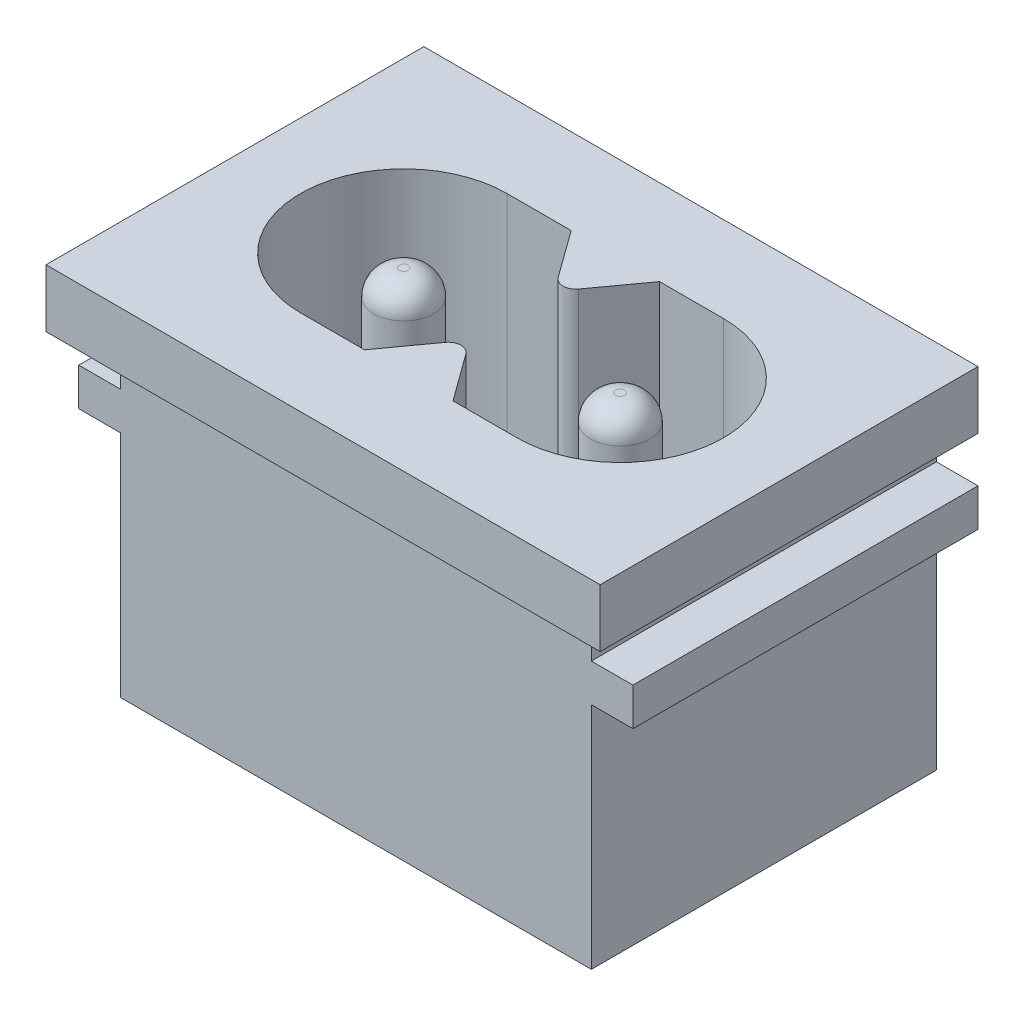
ISO-10303-21;
HEADER;
FILE_DESCRIPTION(('STEP AP214'),'2;1');
FILE_NAME('part.step','',(''),(''),'','','');
FILE_SCHEMA(('AUTOMOTIVE_DESIGN { 1 0 10303 214 1 1 1 1 }'));
ENDSEC;
DATA;
#1=APPLICATION_CONTEXT('core data for automotive mechanical design processes');
#2=APPLICATION_PROTOCOL_DEFINITION('international standard','automotive_design',2000,#1);
#3=PRODUCT_CONTEXT('',#1,'mechanical');
#4=PRODUCT('Part','Part','',(#3));
#5=PRODUCT_RELATED_PRODUCT_CATEGORY('part','',(#4));
#6=PRODUCT_DEFINITION_FORMATION('','',#4);
#7=PRODUCT_DEFINITION_CONTEXT('part definition',#1,'design');
#8=PRODUCT_DEFINITION('design','',#6,#7);
#9=PRODUCT_DEFINITION_SHAPE('','',#8);
#10=(LENGTH_UNIT() NAMED_UNIT(*) SI_UNIT(.MILLI.,.METRE.));
#11=(NAMED_UNIT(*) PLANE_ANGLE_UNIT() SI_UNIT($,.RADIAN.));
#12=(NAMED_UNIT(*) SI_UNIT($,.STERADIAN.) SOLID_ANGLE_UNIT());
#13=UNCERTAINTY_MEASURE_WITH_UNIT(LENGTH_MEASURE(1.E-05),#10,'distance_accuracy_value','');
#14=(GEOMETRIC_REPRESENTATION_CONTEXT(3) GLOBAL_UNCERTAINTY_ASSIGNED_CONTEXT((#13)) GLOBAL_UNIT_ASSIGNED_CONTEXT((#10,
#11,#12)) REPRESENTATION_CONTEXT('',''));
#15=CARTESIAN_POINT('',(0.,0.,0.));
#16=DIRECTION('',(0.,0.,1.));
#17=DIRECTION('',(1.,0.,0.));
#18=AXIS2_PLACEMENT_3D('',#15,#16,#17);
#19=CARTESIAN_POINT('',(9.35,-12.4,-7.5));
#20=DIRECTION('',(-1.,0.,0.));
#21=DIRECTION('',(0.,0.,1.));
#22=AXIS2_PLACEMENT_3D('',#19,#20,#21);
#23=PLANE('',#22);
#24=DIRECTION('',(0.,0.,-1.));
#25=VECTOR('',#24,1.);
#26=CARTESIAN_POINT('',(9.35,-3.3,6.2));
#27=LINE('',#26,#25);
#28=CARTESIAN_POINT('',(9.35,-3.3,6.2));
#29=VERTEX_POINT('',#28);
#30=CARTESIAN_POINT('',(9.35,-3.3,-7.5));
#31=VERTEX_POINT('',#30);
#32=EDGE_CURVE('E342',#29,#31,#27,.T.);
#33=ORIENTED_EDGE('',*,*,#32,.F.);
#34=DIRECTION('',(0.,1.,0.));
#35=VECTOR('',#34,1.);
#36=CARTESIAN_POINT('',(9.35,-12.4,6.2));
#37=LINE('',#36,#35);
#38=CARTESIAN_POINT('',(9.35,-12.4,6.2));
#39=VERTEX_POINT('',#38);
#40=EDGE_CURVE('E406',#39,#29,#37,.T.);
#41=ORIENTED_EDGE('',*,*,#40,.F.);
#42=DIRECTION('',(0.,0.,1.));
#43=VECTOR('',#42,1.);
#44=CARTESIAN_POINT('',(9.35,-12.4,-7.5));
#45=LINE('',#44,#43);
#46=CARTESIAN_POINT('',(9.35,-12.4,-7.5));
#47=VERTEX_POINT('',#46);
#48=EDGE_CURVE('E391',#47,#39,#45,.T.);
#49=ORIENTED_EDGE('',*,*,#48,.F.);
#50=DIRECTION('',(0.,1.,0.));
#51=VECTOR('',#50,1.);
#52=CARTESIAN_POINT('',(9.35,-12.4,-7.5));
#53=LINE('',#52,#51);
#54=EDGE_CURVE('E410',#47,#31,#53,.T.);
#55=ORIENTED_EDGE('',*,*,#54,.T.);
#56=EDGE_LOOP('',(#33,#41,#49,#55));
#57=FACE_BOUND('',#56,.T.);
#58=ADVANCED_FACE('F39',(#57),#23,.F.);
#59=DIRECTION('',(0.,0.,1.));
#60=VECTOR('',#59,1.);
#61=CARTESIAN_POINT('',(9.35,-1.8,-7.5));
#62=LINE('',#61,#60);
#63=CARTESIAN_POINT('',(9.35,-1.8,-7.5));
#64=VERTEX_POINT('',#63);
#65=CARTESIAN_POINT('',(9.35,-1.8,6.2));
#66=VERTEX_POINT('',#65);
#67=EDGE_CURVE('E62',#64,#66,#62,.T.);
#68=ORIENTED_EDGE('',*,*,#67,.F.);
#69=CARTESIAN_POINT('',(9.35,0.,-7.5));
#70=VERTEX_POINT('',#69);
#71=EDGE_CURVE('E409',#64,#70,#53,.T.);
#72=ORIENTED_EDGE('',*,*,#71,.T.);
#73=DIRECTION('',(0.,0.,1.));
#74=VECTOR('',#73,1.);
#75=CARTESIAN_POINT('',(9.35,0.,-7.5));
#76=LINE('',#75,#74);
#77=CARTESIAN_POINT('',(9.35,0.,6.2));
#78=VERTEX_POINT('',#77);
#79=EDGE_CURVE('E398',#70,#78,#76,.T.);
#80=ORIENTED_EDGE('',*,*,#79,.T.);
#81=EDGE_CURVE('E405',#66,#78,#37,.T.);
#82=ORIENTED_EDGE('',*,*,#81,.F.);
#83=EDGE_LOOP('',(#68,#72,#80,#82));
#84=FACE_BOUND('',#83,.T.);
#85=ADVANCED_FACE('F468',(#84),#23,.F.);
#86=CARTESIAN_POINT('',(-9.35,-12.4,-7.5));
#87=DIRECTION('',(1.,0.,0.));
#88=DIRECTION('',(0.,0.,-1.));
#89=AXIS2_PLACEMENT_3D('',#86,#87,#88);
#90=PLANE('',#89);
#91=DIRECTION('',(0.,0.,-1.));
#92=VECTOR('',#91,1.);
#93=CARTESIAN_POINT('',(-9.35,-1.8,-7.5));
#94=LINE('',#93,#92);
#95=CARTESIAN_POINT('',(-9.35,-1.8,6.2));
#96=VERTEX_POINT('',#95);
#97=CARTESIAN_POINT('',(-9.35,-1.8,-7.5));
#98=VERTEX_POINT('',#97);
#99=EDGE_CURVE('E368',#96,#98,#94,.T.);
#100=ORIENTED_EDGE('',*,*,#99,.F.);
#101=DIRECTION('',(0.,1.,0.));
#102=VECTOR('',#101,1.);
#103=CARTESIAN_POINT('',(-9.35,-12.4,6.2));
#104=LINE('',#103,#102);
#105=CARTESIAN_POINT('',(-9.35,0.,6.2));
#106=VERTEX_POINT('',#105);
#107=EDGE_CURVE('E395',#96,#106,#104,.T.);
#108=ORIENTED_EDGE('',*,*,#107,.T.);
#109=DIRECTION('',(0.,0.,-1.));
#110=VECTOR('',#109,1.);
#111=CARTESIAN_POINT('',(-9.35,0.,-7.5));
#112=LINE('',#111,#110);
#113=CARTESIAN_POINT('',(-9.35,0.,-7.5));
#114=VERTEX_POINT('',#113);
#115=EDGE_CURVE('E365',#106,#114,#112,.T.);
#116=ORIENTED_EDGE('',*,*,#115,.T.);
#117=DIRECTION('',(0.,1.,0.));
#118=VECTOR('',#117,1.);
#119=CARTESIAN_POINT('',(-9.35,-12.4,-7.5));
#120=LINE('',#119,#118);
#121=EDGE_CURVE('E413',#98,#114,#120,.T.);
#122=ORIENTED_EDGE('',*,*,#121,.F.);
#123=EDGE_LOOP('',(#100,#108,#116,#122));
#124=FACE_BOUND('',#123,.T.);
#125=ADVANCED_FACE('F474',(#124),#90,.F.);
#126=DIRECTION('',(0.,0.,1.));
#127=VECTOR('',#126,1.);
#128=CARTESIAN_POINT('',(-9.35,-3.3,-7.5));
#129=LINE('',#128,#127);
#130=CARTESIAN_POINT('',(-9.35,-3.3,-7.5));
#131=VERTEX_POINT('',#130);
#132=CARTESIAN_POINT('',(-9.35,-3.3,6.2));
#133=VERTEX_POINT('',#132);
#134=EDGE_CURVE('E340',#131,#133,#129,.T.);
#135=ORIENTED_EDGE('',*,*,#134,.F.);
#136=CARTESIAN_POINT('',(-9.35,-12.4,-7.5));
#137=VERTEX_POINT('',#136);
#138=EDGE_CURVE('E414',#137,#131,#120,.T.);
#139=ORIENTED_EDGE('',*,*,#138,.F.);
#140=DIRECTION('',(0.,0.,-1.));
#141=VECTOR('',#140,1.);
#142=CARTESIAN_POINT('',(-9.35,-12.4,-7.5));
#143=LINE('',#142,#141);
#144=CARTESIAN_POINT('',(-9.35,-12.4,6.2));
#145=VERTEX_POINT('',#144);
#146=EDGE_CURVE('E385',#145,#137,#143,.T.);
#147=ORIENTED_EDGE('',*,*,#146,.F.);
#148=EDGE_CURVE('E403',#145,#133,#104,.T.);
#149=ORIENTED_EDGE('',*,*,#148,.T.);
#150=EDGE_LOOP('',(#135,#139,#147,#149));
#151=FACE_BOUND('',#150,.T.);
#152=ADVANCED_FACE('F483',(#151),#90,.F.);
#153=CARTESIAN_POINT('',(0.,0.,0.));
#154=DIRECTION('',(0.,1.,0.));
#155=DIRECTION('',(0.,0.,1.));
#156=AXIS2_PLACEMENT_3D('',#153,#154,#155);
#157=PLANE('',#156);
#158=ORIENTED_EDGE('',*,*,#115,.F.);
#159=DIRECTION('',(-1.,0.,0.));
#160=VECTOR('',#159,1.);
#161=CARTESIAN_POINT('',(-9.35,0.,6.2));
#162=LINE('',#161,#160);
#163=EDGE_CURVE('E389',#78,#106,#162,.T.);
#164=ORIENTED_EDGE('',*,*,#163,.F.);
#165=ORIENTED_EDGE('',*,*,#79,.F.);
#166=DIRECTION('',(-1.,0.,0.));
#167=VECTOR('',#166,1.);
#168=CARTESIAN_POINT('',(11.,0.,-7.5));
#169=LINE('',#168,#167);
#170=CARTESIAN_POINT('',(11.,0.,-7.5));
#171=VERTEX_POINT('',#170);
#172=EDGE_CURVE('E422',#171,#70,#169,.T.);
#173=ORIENTED_EDGE('',*,*,#172,.F.);
#174=DIRECTION('',(0.,0.,-1.));
#175=VECTOR('',#174,1.);
#176=CARTESIAN_POINT('',(11.,0.,7.5));
#177=LINE('',#176,#175);
#178=CARTESIAN_POINT('',(11.,0.,7.5));
#179=VERTEX_POINT('',#178);
#180=EDGE_CURVE('E433',#179,#171,#177,.T.);
#181=ORIENTED_EDGE('',*,*,#180,.F.);
#182=DIRECTION('',(1.,0.,0.));
#183=VECTOR('',#182,1.);
#184=CARTESIAN_POINT('',(11.,0.,7.5));
#185=LINE('',#184,#183);
#186=CARTESIAN_POINT('',(-11.,0.,7.5));
#187=VERTEX_POINT('',#186);
#188=EDGE_CURVE('E431',#187,#179,#185,.T.);
#189=ORIENTED_EDGE('',*,*,#188,.F.);
#190=DIRECTION('',(0.,0.,1.));
#191=VECTOR('',#190,1.);
#192=CARTESIAN_POINT('',(-11.,0.,7.5));
#193=LINE('',#192,#191);
#194=CARTESIAN_POINT('',(-11.,0.,-7.5));
#195=VERTEX_POINT('',#194);
#196=EDGE_CURVE('E417',#195,#187,#193,.T.);
#197=ORIENTED_EDGE('',*,*,#196,.F.);
#198=EDGE_CURVE('E435',#114,#195,#169,.T.);
#199=ORIENTED_EDGE('',*,*,#198,.F.);
#200=EDGE_LOOP('',(#158,#164,#165,#173,#181,#189,#197,#199));
#201=FACE_BOUND('',#200,.T.);
#202=ADVANCED_FACE('F490',(#201),#157,.F.);
#203=CARTESIAN_POINT('',(-11.,2.3,7.5));
#204=DIRECTION('',(1.,0.,0.));
#205=DIRECTION('',(0.,0.,-1.));
#206=AXIS2_PLACEMENT_3D('',#203,#204,#205);
#207=PLANE('',#206);
#208=ORIENTED_EDGE('',*,*,#196,.T.);
#209=DIRECTION('',(0.,-1.,0.));
#210=VECTOR('',#209,1.);
#211=CARTESIAN_POINT('',(-11.,2.3,7.5));
#212=LINE('',#211,#210);
#213=CARTESIAN_POINT('',(-11.,2.3,7.5));
#214=VERTEX_POINT('',#213);
#215=EDGE_CURVE('E446',#214,#187,#212,.T.);
#216=ORIENTED_EDGE('',*,*,#215,.F.);
#217=DIRECTION('',(0.,0.,1.));
#218=VECTOR('',#217,1.);
#219=CARTESIAN_POINT('',(-11.,2.3,7.5));
#220=LINE('',#219,#218);
#221=CARTESIAN_POINT('',(-11.,2.3,-7.5));
#222=VERTEX_POINT('',#221);
#223=EDGE_CURVE('E418',#222,#214,#220,.T.);
#224=ORIENTED_EDGE('',*,*,#223,.F.);
#225=DIRECTION('',(0.,-1.,0.));
#226=VECTOR('',#225,1.);
#227=CARTESIAN_POINT('',(-11.,2.3,-7.5));
#228=LINE('',#227,#226);
#229=EDGE_CURVE('E428',#222,#195,#228,.T.);
#230=ORIENTED_EDGE('',*,*,#229,.T.);
#231=EDGE_LOOP('',(#208,#216,#224,#230));
#232=FACE_BOUND('',#231,.T.);
#233=ADVANCED_FACE('F493',(#232),#207,.F.);
#234=CARTESIAN_POINT('',(11.,2.3,7.5));
#235=DIRECTION('',(0.,0.,-1.));
#236=DIRECTION('',(-1.,0.,0.));
#237=AXIS2_PLACEMENT_3D('',#234,#235,#236);
#238=PLANE('',#237);
#239=ORIENTED_EDGE('',*,*,#188,.T.);
#240=DIRECTION('',(0.,-1.,0.));
#241=VECTOR('',#240,1.);
#242=CARTESIAN_POINT('',(11.,2.3,7.5));
#243=LINE('',#242,#241);
#244=CARTESIAN_POINT('',(11.,2.3,7.5));
#245=VERTEX_POINT('',#244);
#246=EDGE_CURVE('E443',#245,#179,#243,.T.);
#247=ORIENTED_EDGE('',*,*,#246,.F.);
#248=DIRECTION('',(1.,0.,0.));
#249=VECTOR('',#248,1.);
#250=CARTESIAN_POINT('',(11.,2.3,7.5));
#251=LINE('',#250,#249);
#252=EDGE_CURVE('E421',#214,#245,#251,.T.);
#253=ORIENTED_EDGE('',*,*,#252,.F.);
#254=ORIENTED_EDGE('',*,*,#215,.T.);
#255=EDGE_LOOP('',(#239,#247,#253,#254));
#256=FACE_BOUND('',#255,.T.);
#257=ADVANCED_FACE('F501',(#256),#238,.F.);
#258=CARTESIAN_POINT('',(11.,2.3,7.5));
#259=DIRECTION('',(-1.,0.,0.));
#260=DIRECTION('',(0.,0.,1.));
#261=AXIS2_PLACEMENT_3D('',#258,#259,#260);
#262=PLANE('',#261);
#263=ORIENTED_EDGE('',*,*,#180,.T.);
#264=DIRECTION('',(0.,-1.,0.));
#265=VECTOR('',#264,1.);
#266=CARTESIAN_POINT('',(11.,2.3,-7.5));
#267=LINE('',#266,#265);
#268=CARTESIAN_POINT('',(11.,2.3,-7.5));
#269=VERTEX_POINT('',#268);
#270=EDGE_CURVE('E440',#269,#171,#267,.T.);
#271=ORIENTED_EDGE('',*,*,#270,.F.);
#272=DIRECTION('',(0.,0.,-1.));
#273=VECTOR('',#272,1.);
#274=CARTESIAN_POINT('',(11.,2.3,7.5));
#275=LINE('',#274,#273);
#276=EDGE_CURVE('E424',#245,#269,#275,.T.);
#277=ORIENTED_EDGE('',*,*,#276,.F.);
#278=ORIENTED_EDGE('',*,*,#246,.T.);
#279=EDGE_LOOP('',(#263,#271,#277,#278));
#280=FACE_BOUND('',#279,.T.);
#281=ADVANCED_FACE('F497',(#280),#262,.F.);
#282=CARTESIAN_POINT('',(11.,2.3,-7.5));
#283=DIRECTION('',(0.,0.,1.));
#284=DIRECTION('',(1.,0.,0.));
#285=AXIS2_PLACEMENT_3D('',#282,#283,#284);
#286=PLANE('',#285);
#287=ORIENTED_EDGE('',*,*,#172,.T.);
#288=ORIENTED_EDGE('',*,*,#71,.F.);
#289=DIRECTION('',(-1.,0.,0.));
#290=VECTOR('',#289,1.);
#291=CARTESIAN_POINT('',(24.7818721514894,-1.8,-7.5));
#292=LINE('',#291,#290);
#293=CARTESIAN_POINT('',(11.,-1.8,-7.5));
#294=VERTEX_POINT('',#293);
#295=EDGE_CURVE('E351',#294,#64,#292,.T.);
#296=ORIENTED_EDGE('',*,*,#295,.F.);
#297=DIRECTION('',(0.,-1.,0.));
#298=VECTOR('',#297,1.);
#299=CARTESIAN_POINT('',(11.,-3.3,-7.5));
#300=LINE('',#299,#298);
#301=CARTESIAN_POINT('',(11.,-3.3,-7.5));
#302=VERTEX_POINT('',#301);
#303=EDGE_CURVE('E337',#294,#302,#300,.T.);
#304=ORIENTED_EDGE('',*,*,#303,.T.);
#305=DIRECTION('',(-1.,0.,0.));
#306=VECTOR('',#305,1.);
#307=CARTESIAN_POINT('',(24.7818721514894,-3.3,-7.5));
#308=LINE('',#307,#306);
#309=EDGE_CURVE('E345',#302,#31,#308,.T.);
#310=ORIENTED_EDGE('',*,*,#309,.T.);
#311=ORIENTED_EDGE('',*,*,#54,.F.);
#312=DIRECTION('',(1.,0.,0.));
#313=VECTOR('',#312,1.);
#314=CARTESIAN_POINT('',(-9.35,-12.4,-7.5));
#315=LINE('',#314,#313);
#316=EDGE_CURVE('E388',#137,#47,#315,.T.);
#317=ORIENTED_EDGE('',*,*,#316,.F.);
#318=ORIENTED_EDGE('',*,*,#138,.T.);
#319=DIRECTION('',(1.,0.,0.));
#320=VECTOR('',#319,1.);
#321=CARTESIAN_POINT('',(-24.7818721514894,-3.3,-7.5));
#322=LINE('',#321,#320);
#323=CARTESIAN_POINT('',(-11.,-3.3,-7.5));
#324=VERTEX_POINT('',#323);
#325=EDGE_CURVE('E380',#324,#131,#322,.T.);
#326=ORIENTED_EDGE('',*,*,#325,.F.);
#327=DIRECTION('',(0.,1.,0.));
#328=VECTOR('',#327,1.);
#329=CARTESIAN_POINT('',(-11.,-1.8,-7.5));
#330=LINE('',#329,#328);
#331=CARTESIAN_POINT('',(-11.,-1.8,-7.5));
#332=VERTEX_POINT('',#331);
#333=EDGE_CURVE('E362',#324,#332,#330,.T.);
#334=ORIENTED_EDGE('',*,*,#333,.T.);
#335=DIRECTION('',(1.,0.,0.));
#336=VECTOR('',#335,1.);
#337=CARTESIAN_POINT('',(-24.7818721514894,-1.8,-7.5));
#338=LINE('',#337,#336);
#339=EDGE_CURVE('E371',#332,#98,#338,.T.);
#340=ORIENTED_EDGE('',*,*,#339,.T.);
#341=ORIENTED_EDGE('',*,*,#121,.T.);
#342=ORIENTED_EDGE('',*,*,#198,.T.);
#343=ORIENTED_EDGE('',*,*,#229,.F.);
#344=DIRECTION('',(-1.,0.,0.));
#345=VECTOR('',#344,1.);
#346=CARTESIAN_POINT('',(11.,2.3,-7.5));
#347=LINE('',#346,#345);
#348=EDGE_CURVE('E426',#269,#222,#347,.T.);
#349=ORIENTED_EDGE('',*,*,#348,.F.);
#350=ORIENTED_EDGE('',*,*,#270,.T.);
#351=EDGE_LOOP('',(#287,#288,#296,#304,#310,#311,#317,#318,#326,#334,#340,#341,#342,#343,#349,#350));
#352=FACE_BOUND('',#351,.T.);
#353=ADVANCED_FACE('F488',(#352),#286,.F.);
#354=CARTESIAN_POINT('',(0.,2.3,0.));
#355=DIRECTION('',(0.,1.,0.));
#356=DIRECTION('',(0.,0.,1.));
#357=AXIS2_PLACEMENT_3D('',#354,#355,#356);
#358=PLANE('',#357);
#359=CARTESIAN_POINT('',(-4.3,2.3,0.));
#360=DIRECTION('',(0.,1.,0.));
#361=DIRECTION('',(0.,0.,1.));
#362=AXIS2_PLACEMENT_3D('',#359,#360,#361);
#363=CIRCLE('',#362,4.1);
#364=CARTESIAN_POINT('',(-4.3,2.3,-4.1));
#365=VERTEX_POINT('',#364);
#366=CARTESIAN_POINT('',(-4.3,2.3,4.1));
#367=VERTEX_POINT('',#366);
#368=EDGE_CURVE('E54',#365,#367,#363,.T.);
#369=ORIENTED_EDGE('',*,*,#368,.F.);
#370=DIRECTION('',(-1.,0.,-1.2322999374738E-11));
#371=VECTOR('',#370,1.);
#372=CARTESIAN_POINT('',(-4.3,2.3,-4.1));
#373=LINE('',#372,#371);
#374=CARTESIAN_POINT('',(-1.75,2.3,-4.09999999996858));
#375=VERTEX_POINT('',#374);
#376=EDGE_CURVE('E246',#375,#365,#373,.T.);
#377=ORIENTED_EDGE('',*,*,#376,.F.);
#378=DIRECTION('',(-0.585865415007771,0.,-0.810408363417958));
#379=VECTOR('',#378,1.);
#380=CARTESIAN_POINT('',(-1.75,2.3,-4.09999999996858));
#381=LINE('',#380,#379);
#382=CARTESIAN_POINT('',(-0.404340982942637,2.3,-2.23859413132277));
#383=VERTEX_POINT('',#382);
#384=EDGE_CURVE('E249',#383,#375,#381,.T.);
#385=ORIENTED_EDGE('',*,*,#384,.F.);
#386=CARTESIAN_POINT('',(0.000863198766344499,2.3,-2.53152683882665));
#387=DIRECTION('',(0.,-1.,0.));
#388=DIRECTION('',(0.,0.,-1.));
#389=AXIS2_PLACEMENT_3D('',#386,#387,#388);
#390=CIRCLE('',#389,0.5);
#391=CARTESIAN_POINT('',(0.40547315376918,2.3,-2.23777390809641));
#392=VERTEX_POINT('',#391);
#393=EDGE_CURVE('E304',#392,#383,#390,.T.);
#394=ORIENTED_EDGE('',*,*,#393,.F.);
#395=DIRECTION('',(-0.587505861460482,0.,0.809219910005665));
#396=VECTOR('',#395,1.);
#397=CARTESIAN_POINT('',(0.40547315376918,2.3,-2.23777390809641));
#398=LINE('',#397,#396);
#399=CARTESIAN_POINT('',(1.75747738751368,2.3,-4.1));
#400=VERTEX_POINT('',#399);
#401=EDGE_CURVE('E301',#400,#392,#398,.T.);
#402=ORIENTED_EDGE('',*,*,#401,.F.);
#403=DIRECTION('',(-1.,0.,0.));
#404=VECTOR('',#403,1.);
#405=CARTESIAN_POINT('',(1.75747738751368,2.3,-4.1));
#406=LINE('',#405,#404);
#407=CARTESIAN_POINT('',(4.3,2.3,-4.1));
#408=VERTEX_POINT('',#407);
#409=EDGE_CURVE('E298',#408,#400,#406,.T.);
#410=ORIENTED_EDGE('',*,*,#409,.F.);
#411=CARTESIAN_POINT('',(4.3,2.3,0.));
#412=DIRECTION('',(0.,1.,0.));
#413=DIRECTION('',(0.,0.,-1.));
#414=AXIS2_PLACEMENT_3D('',#411,#412,#413);
#415=CIRCLE('',#414,4.1);
#416=CARTESIAN_POINT('',(4.3,2.3,4.1));
#417=VERTEX_POINT('',#416);
#418=EDGE_CURVE('E295',#417,#408,#415,.T.);
#419=ORIENTED_EDGE('',*,*,#418,.F.);
#420=DIRECTION('',(1.,0.,0.));
#421=VECTOR('',#420,1.);
#422=CARTESIAN_POINT('',(1.75747738751368,2.3,4.1));
#423=LINE('',#422,#421);
#424=CARTESIAN_POINT('',(1.75747738751368,2.3,4.1));
#425=VERTEX_POINT('',#424);
#426=EDGE_CURVE('E292',#425,#417,#423,.T.);
#427=ORIENTED_EDGE('',*,*,#426,.F.);
#428=DIRECTION('',(0.587505861458465,0.,0.80921991000713));
#429=VECTOR('',#428,1.);
#430=CARTESIAN_POINT('',(0.405473153784829,2.3,2.2377739081082));
#431=LINE('',#430,#429);
#432=CARTESIAN_POINT('',(0.405473153784829,2.3,2.2377739081082));
#433=VERTEX_POINT('',#432);
#434=EDGE_CURVE('E289',#433,#425,#431,.T.);
#435=ORIENTED_EDGE('',*,*,#434,.F.);
#436=CARTESIAN_POINT('',(0.000863198766344499,2.3,2.53152683882665));
#437=DIRECTION('',(0.,-1.,0.));
#438=DIRECTION('',(0.,0.,1.));
#439=AXIS2_PLACEMENT_3D('',#436,#437,#438);
#440=CIRCLE('',#439,0.500000000002868);
#441=CARTESIAN_POINT('',(-0.404340982942333,2.3,2.23859413131745));
#442=VERTEX_POINT('',#441);
#443=EDGE_CURVE('E286',#442,#433,#440,.T.);
#444=ORIENTED_EDGE('',*,*,#443,.F.);
#445=DIRECTION('',(0.585865415007771,0.,-0.810408363417958));
#446=VECTOR('',#445,1.);
#447=CARTESIAN_POINT('',(-1.75,2.3,4.09999999996858));
#448=LINE('',#447,#446);
#449=CARTESIAN_POINT('',(-1.75,2.3,4.09999999996858));
#450=VERTEX_POINT('',#449);
#451=EDGE_CURVE('E283',#450,#442,#448,.T.);
#452=ORIENTED_EDGE('',*,*,#451,.F.);
#453=DIRECTION('',(1.,0.,-1.2322999374738E-11));
#454=VECTOR('',#453,1.);
#455=CARTESIAN_POINT('',(-4.3,2.3,4.1));
#456=LINE('',#455,#454);
#457=EDGE_CURVE('E281',#367,#450,#456,.T.);
#458=ORIENTED_EDGE('',*,*,#457,.F.);
#459=EDGE_LOOP('',(#369,#377,#385,#394,#402,#410,#419,#427,#435,#444,#452,#458));
#460=FACE_BOUND('',#459,.T.);
#461=ORIENTED_EDGE('',*,*,#223,.T.);
#462=ORIENTED_EDGE('',*,*,#252,.T.);
#463=ORIENTED_EDGE('',*,*,#276,.T.);
#464=ORIENTED_EDGE('',*,*,#348,.T.);
#465=EDGE_LOOP('',(#461,#462,#463,#464));
#466=FACE_BOUND('',#465,.T.);
#467=ADVANCED_FACE('F485',(#460,#466),#358,.T.);
#468=CARTESIAN_POINT('',(-9.35,-12.4,6.2));
#469=DIRECTION('',(0.,0.,-1.));
#470=DIRECTION('',(-1.,0.,0.));
#471=AXIS2_PLACEMENT_3D('',#468,#469,#470);
#472=PLANE('',#471);
#473=ORIENTED_EDGE('',*,*,#163,.T.);
#474=ORIENTED_EDGE('',*,*,#107,.F.);
#475=DIRECTION('',(1.,0.,0.));
#476=VECTOR('',#475,1.);
#477=CARTESIAN_POINT('',(-24.7818721514894,-1.8,6.2));
#478=LINE('',#477,#476);
#479=CARTESIAN_POINT('',(-11.,-1.8,6.2));
#480=VERTEX_POINT('',#479);
#481=EDGE_CURVE('E374',#480,#96,#478,.T.);
#482=ORIENTED_EDGE('',*,*,#481,.F.);
#483=DIRECTION('',(0.,-1.,0.));
#484=VECTOR('',#483,1.);
#485=CARTESIAN_POINT('',(-11.,-1.8,6.2));
#486=LINE('',#485,#484);
#487=CARTESIAN_POINT('',(-11.,-3.3,6.19999999999999));
#488=VERTEX_POINT('',#487);
#489=EDGE_CURVE('E355',#480,#488,#486,.T.);
#490=ORIENTED_EDGE('',*,*,#489,.T.);
#491=DIRECTION('',(1.,0.,0.));
#492=VECTOR('',#491,1.);
#493=CARTESIAN_POINT('',(-24.7818721514894,-3.3,6.19999999999999));
#494=LINE('',#493,#492);
#495=EDGE_CURVE('E377',#488,#133,#494,.T.);
#496=ORIENTED_EDGE('',*,*,#495,.T.);
#497=ORIENTED_EDGE('',*,*,#148,.F.);
#498=DIRECTION('',(-1.,0.,0.));
#499=VECTOR('',#498,1.);
#500=CARTESIAN_POINT('',(-9.35,-12.4,6.2));
#501=LINE('',#500,#499);
#502=EDGE_CURVE('E393',#39,#145,#501,.T.);
#503=ORIENTED_EDGE('',*,*,#502,.F.);
#504=ORIENTED_EDGE('',*,*,#40,.T.);
#505=DIRECTION('',(-1.,0.,0.));
#506=VECTOR('',#505,1.);
#507=CARTESIAN_POINT('',(24.7818721514894,-3.3,6.2));
#508=LINE('',#507,#506);
#509=CARTESIAN_POINT('',(11.,-3.3,6.2));
#510=VERTEX_POINT('',#509);
#511=EDGE_CURVE('E347',#510,#29,#508,.T.);
#512=ORIENTED_EDGE('',*,*,#511,.F.);
#513=DIRECTION('',(0.,1.,0.));
#514=VECTOR('',#513,1.);
#515=CARTESIAN_POINT('',(11.,-1.8,6.2));
#516=LINE('',#515,#514);
#517=CARTESIAN_POINT('',(11.,-1.8,6.2));
#518=VERTEX_POINT('',#517);
#519=EDGE_CURVE('E330',#510,#518,#516,.T.);
#520=ORIENTED_EDGE('',*,*,#519,.T.);
#521=DIRECTION('',(-1.,0.,0.));
#522=VECTOR('',#521,1.);
#523=CARTESIAN_POINT('',(24.7818721514894,-1.8,6.2));
#524=LINE('',#523,#522);
#525=EDGE_CURVE('E349',#518,#66,#524,.T.);
#526=ORIENTED_EDGE('',*,*,#525,.T.);
#527=ORIENTED_EDGE('',*,*,#81,.T.);
#528=EDGE_LOOP('',(#473,#474,#482,#490,#496,#497,#503,#504,#512,#520,#526,#527));
#529=FACE_BOUND('',#528,.T.);
#530=ADVANCED_FACE('F479',(#529),#472,.F.);
#531=CARTESIAN_POINT('',(0.,-12.4,0.));
#532=DIRECTION('',(0.,1.,0.));
#533=DIRECTION('',(0.,0.,1.));
#534=AXIS2_PLACEMENT_3D('',#531,#532,#533);
#535=PLANE('',#534);
#536=ORIENTED_EDGE('',*,*,#146,.T.);
#537=ORIENTED_EDGE('',*,*,#316,.T.);
#538=ORIENTED_EDGE('',*,*,#48,.T.);
#539=ORIENTED_EDGE('',*,*,#502,.T.);
#540=EDGE_LOOP('',(#536,#537,#538,#539));
#541=FACE_BOUND('',#540,.T.);
#542=ADVANCED_FACE('F544',(#541),#535,.F.);
#543=CARTESIAN_POINT('',(-24.7818721514894,-1.8,-7.5));
#544=DIRECTION('',(0.,-1.,0.));
#545=DIRECTION('',(0.,0.,-1.));
#546=AXIS2_PLACEMENT_3D('',#543,#544,#545);
#547=PLANE('',#546);
#548=ORIENTED_EDGE('',*,*,#339,.F.);
#549=DIRECTION('',(0.,0.,1.));
#550=VECTOR('',#549,1.);
#551=CARTESIAN_POINT('',(-11.,-1.8,-7.5));
#552=LINE('',#551,#550);
#553=EDGE_CURVE('E359',#332,#480,#552,.T.);
#554=ORIENTED_EDGE('',*,*,#553,.T.);
#555=ORIENTED_EDGE('',*,*,#481,.T.);
#556=ORIENTED_EDGE('',*,*,#99,.T.);
#557=EDGE_LOOP('',(#548,#554,#555,#556));
#558=FACE_BOUND('',#557,.T.);
#559=ADVANCED_FACE('F556',(#558),#547,.F.);
#560=CARTESIAN_POINT('',(-24.7818721514894,-3.3,-7.5));
#561=DIRECTION('',(0.,1.,0.));
#562=DIRECTION('',(0.,0.,1.));
#563=AXIS2_PLACEMENT_3D('',#560,#561,#562);
#564=PLANE('',#563);
#565=ORIENTED_EDGE('',*,*,#495,.F.);
#566=DIRECTION('',(0.,0.,-1.));
#567=VECTOR('',#566,1.);
#568=CARTESIAN_POINT('',(-11.,-3.3,-7.5));
#569=LINE('',#568,#567);
#570=EDGE_CURVE('E358',#488,#324,#569,.T.);
#571=ORIENTED_EDGE('',*,*,#570,.T.);
#572=ORIENTED_EDGE('',*,*,#325,.T.);
#573=ORIENTED_EDGE('',*,*,#134,.T.);
#574=EDGE_LOOP('',(#565,#571,#572,#573));
#575=FACE_BOUND('',#574,.T.);
#576=ADVANCED_FACE('F552',(#575),#564,.F.);
#577=CARTESIAN_POINT('',(-11.,2.3,7.5));
#578=DIRECTION('',(1.,0.,0.));
#579=DIRECTION('',(0.,0.,-1.));
#580=AXIS2_PLACEMENT_3D('',#577,#578,#579);
#581=PLANE('',#580);
#582=ORIENTED_EDGE('',*,*,#570,.F.);
#583=ORIENTED_EDGE('',*,*,#489,.F.);
#584=ORIENTED_EDGE('',*,*,#553,.F.);
#585=ORIENTED_EDGE('',*,*,#333,.F.);
#586=EDGE_LOOP('',(#582,#583,#584,#585));
#587=FACE_BOUND('',#586,.T.);
#588=ADVANCED_FACE('F554',(#587),#581,.F.);
#589=CARTESIAN_POINT('',(24.7818721514894,-3.3,6.2));
#590=DIRECTION('',(0.,1.,0.));
#591=DIRECTION('',(0.,0.,1.));
#592=AXIS2_PLACEMENT_3D('',#589,#590,#591);
#593=PLANE('',#592);
#594=ORIENTED_EDGE('',*,*,#309,.F.);
#595=DIRECTION('',(0.,0.,1.));
#596=VECTOR('',#595,1.);
#597=CARTESIAN_POINT('',(11.,-3.3,6.2));
#598=LINE('',#597,#596);
#599=EDGE_CURVE('E334',#302,#510,#598,.T.);
#600=ORIENTED_EDGE('',*,*,#599,.T.);
#601=ORIENTED_EDGE('',*,*,#511,.T.);
#602=ORIENTED_EDGE('',*,*,#32,.T.);
#603=EDGE_LOOP('',(#594,#600,#601,#602));
#604=FACE_BOUND('',#603,.T.);
#605=ADVANCED_FACE('F538',(#604),#593,.F.);
#606=CARTESIAN_POINT('',(24.7818721514894,-1.8,-7.5));
#607=DIRECTION('',(0.,-1.,0.));
#608=DIRECTION('',(0.,0.,-1.));
#609=AXIS2_PLACEMENT_3D('',#606,#607,#608);
#610=PLANE('',#609);
#611=ORIENTED_EDGE('',*,*,#525,.F.);
#612=DIRECTION('',(0.,0.,-1.));
#613=VECTOR('',#612,1.);
#614=CARTESIAN_POINT('',(11.,-1.8,-7.5));
#615=LINE('',#614,#613);
#616=EDGE_CURVE('E333',#518,#294,#615,.T.);
#617=ORIENTED_EDGE('',*,*,#616,.T.);
#618=ORIENTED_EDGE('',*,*,#295,.T.);
#619=ORIENTED_EDGE('',*,*,#67,.T.);
#620=EDGE_LOOP('',(#611,#617,#618,#619));
#621=FACE_BOUND('',#620,.T.);
#622=ADVANCED_FACE('F533',(#621),#610,.F.);
#623=CARTESIAN_POINT('',(11.,2.3,7.5));
#624=DIRECTION('',(-1.,0.,0.));
#625=DIRECTION('',(0.,0.,1.));
#626=AXIS2_PLACEMENT_3D('',#623,#624,#625);
#627=PLANE('',#626);
#628=ORIENTED_EDGE('',*,*,#616,.F.);
#629=ORIENTED_EDGE('',*,*,#519,.F.);
#630=ORIENTED_EDGE('',*,*,#599,.F.);
#631=ORIENTED_EDGE('',*,*,#303,.F.);
#632=EDGE_LOOP('',(#628,#629,#630,#631));
#633=FACE_BOUND('',#632,.T.);
#634=ADVANCED_FACE('F535',(#633),#627,.F.);
#635=CARTESIAN_POINT('',(-4.3,-7.7,0.));
#636=DIRECTION('',(0.,1.,0.));
#637=DIRECTION('',(0.,0.,1.));
#638=AXIS2_PLACEMENT_3D('',#635,#636,#637);
#639=CYLINDRICAL_SURFACE('',#638,4.1);
#640=ORIENTED_EDGE('',*,*,#368,.T.);
#641=DIRECTION('',(0.,1.,0.));
#642=VECTOR('',#641,1.);
#643=CARTESIAN_POINT('',(-4.3,-7.7,4.1));
#644=LINE('',#643,#642);
#645=CARTESIAN_POINT('',(-4.3,-7.7,4.1));
#646=VERTEX_POINT('',#645);
#647=EDGE_CURVE('E223',#646,#367,#644,.T.);
#648=ORIENTED_EDGE('',*,*,#647,.F.);
#649=CARTESIAN_POINT('',(-4.3,-7.7,0.));
#650=DIRECTION('',(0.,1.,0.));
#651=DIRECTION('',(0.,0.,1.));
#652=AXIS2_PLACEMENT_3D('',#649,#650,#651);
#653=CIRCLE('',#652,4.1);
#654=CARTESIAN_POINT('',(-4.3,-7.7,-4.1));
#655=VERTEX_POINT('',#654);
#656=EDGE_CURVE('E227',#655,#646,#653,.T.);
#657=ORIENTED_EDGE('',*,*,#656,.F.);
#658=DIRECTION('',(0.,1.,0.));
#659=VECTOR('',#658,1.);
#660=CARTESIAN_POINT('',(-4.3,-7.7,-4.1));
#661=LINE('',#660,#659);
#662=EDGE_CURVE('E309',#655,#365,#661,.T.);
#663=ORIENTED_EDGE('',*,*,#662,.T.);
#664=EDGE_LOOP('',(#640,#648,#657,#663));
#665=FACE_BOUND('',#664,.T.);
#666=ADVANCED_FACE('F225',(#665),#639,.F.);
#667=CARTESIAN_POINT('',(-4.3,-7.7,-4.1));
#668=DIRECTION('',(1.2322999374738E-11,0.,-1.));
#669=DIRECTION('',(-1.,0.,-1.2322999374738E-11));
#670=AXIS2_PLACEMENT_3D('',#667,#668,#669);
#671=PLANE('',#670);
#672=ORIENTED_EDGE('',*,*,#376,.T.);
#673=ORIENTED_EDGE('',*,*,#662,.F.);
#674=DIRECTION('',(-1.,0.,-1.2322999374738E-11));
#675=VECTOR('',#674,1.);
#676=CARTESIAN_POINT('',(-4.3,-7.7,-4.1));
#677=LINE('',#676,#675);
#678=CARTESIAN_POINT('',(-1.75,-7.7,-4.09999999996858));
#679=VERTEX_POINT('',#678);
#680=EDGE_CURVE('E233',#679,#655,#677,.T.);
#681=ORIENTED_EDGE('',*,*,#680,.F.);
#682=DIRECTION('',(0.,1.,0.));
#683=VECTOR('',#682,1.);
#684=CARTESIAN_POINT('',(-1.75,-7.7,-4.09999999996858));
#685=LINE('',#684,#683);
#686=EDGE_CURVE('E311',#679,#375,#685,.T.);
#687=ORIENTED_EDGE('',*,*,#686,.T.);
#688=EDGE_LOOP('',(#672,#673,#681,#687));
#689=FACE_BOUND('',#688,.T.);
#690=ADVANCED_FACE('F575',(#689),#671,.F.);
#691=CARTESIAN_POINT('',(-1.75,-7.7,-4.09999999996858));
#692=DIRECTION('',(0.810408363417958,0.,-0.585865415007771));
#693=DIRECTION('',(-0.585865415007771,0.,-0.810408363417958));
#694=AXIS2_PLACEMENT_3D('',#691,#692,#693);
#695=PLANE('',#694);
#696=ORIENTED_EDGE('',*,*,#384,.T.);
#697=ORIENTED_EDGE('',*,*,#686,.F.);
#698=DIRECTION('',(-0.585865415007771,0.,-0.810408363417958));
#699=VECTOR('',#698,1.);
#700=CARTESIAN_POINT('',(-1.75,-7.7,-4.09999999996858));
#701=LINE('',#700,#699);
#702=CARTESIAN_POINT('',(-0.404340982942637,-7.7,-2.23859413132277));
#703=VERTEX_POINT('',#702);
#704=EDGE_CURVE('E277',#703,#679,#701,.T.);
#705=ORIENTED_EDGE('',*,*,#704,.F.);
#706=DIRECTION('',(0.,1.,0.));
#707=VECTOR('',#706,1.);
#708=CARTESIAN_POINT('',(-0.404340982942637,-7.7,-2.23859413132277));
#709=LINE('',#708,#707);
#710=EDGE_CURVE('E313',#703,#383,#709,.T.);
#711=ORIENTED_EDGE('',*,*,#710,.T.);
#712=EDGE_LOOP('',(#696,#697,#705,#711));
#713=FACE_BOUND('',#712,.T.);
#714=ADVANCED_FACE('F609',(#713),#695,.F.);
#715=CARTESIAN_POINT('',(0.000863198766344499,-7.7,-2.53152683882665));
#716=DIRECTION('',(0.,1.,0.));
#717=DIRECTION('',(0.,0.,1.));
#718=AXIS2_PLACEMENT_3D('',#715,#716,#717);
#719=CYLINDRICAL_SURFACE('',#718,0.5);
#720=ORIENTED_EDGE('',*,*,#393,.T.);
#721=ORIENTED_EDGE('',*,*,#710,.F.);
#722=CARTESIAN_POINT('',(0.000863198766344499,-7.7,-2.53152683882665));
#723=DIRECTION('',(0.,-1.,0.));
#724=DIRECTION('',(0.,0.,-1.));
#725=AXIS2_PLACEMENT_3D('',#722,#723,#724);
#726=CIRCLE('',#725,0.5);
#727=CARTESIAN_POINT('',(0.40547315376918,-7.7,-2.23777390809641));
#728=VERTEX_POINT('',#727);
#729=EDGE_CURVE('E274',#728,#703,#726,.T.);
#730=ORIENTED_EDGE('',*,*,#729,.F.);
#731=DIRECTION('',(0.,1.,0.));
#732=VECTOR('',#731,1.);
#733=CARTESIAN_POINT('',(0.40547315376918,-7.7,-2.23777390809641));
#734=LINE('',#733,#732);
#735=EDGE_CURVE('E315',#728,#392,#734,.T.);
#736=ORIENTED_EDGE('',*,*,#735,.T.);
#737=EDGE_LOOP('',(#720,#721,#730,#736));
#738=FACE_BOUND('',#737,.T.);
#739=ADVANCED_FACE('F605',(#738),#719,.T.);
#740=CARTESIAN_POINT('',(0.40547315376918,-7.7,-2.23777390809641));
#741=DIRECTION('',(-0.809219910005665,0.,-0.587505861460482));
#742=DIRECTION('',(-0.587505861460482,0.,0.809219910005665));
#743=AXIS2_PLACEMENT_3D('',#740,#741,#742);
#744=PLANE('',#743);
#745=ORIENTED_EDGE('',*,*,#401,.T.);
#746=ORIENTED_EDGE('',*,*,#735,.F.);
#747=DIRECTION('',(-0.587505861460482,0.,0.809219910005665));
#748=VECTOR('',#747,1.);
#749=CARTESIAN_POINT('',(0.40547315376918,-7.7,-2.23777390809641));
#750=LINE('',#749,#748);
#751=CARTESIAN_POINT('',(1.75747738751368,-7.7,-4.1));
#752=VERTEX_POINT('',#751);
#753=EDGE_CURVE('E271',#752,#728,#750,.T.);
#754=ORIENTED_EDGE('',*,*,#753,.F.);
#755=DIRECTION('',(0.,1.,0.));
#756=VECTOR('',#755,1.);
#757=CARTESIAN_POINT('',(1.75747738751368,-7.7,-4.1));
#758=LINE('',#757,#756);
#759=EDGE_CURVE('E317',#752,#400,#758,.T.);
#760=ORIENTED_EDGE('',*,*,#759,.T.);
#761=EDGE_LOOP('',(#745,#746,#754,#760));
#762=FACE_BOUND('',#761,.T.);
#763=ADVANCED_FACE('F601',(#762),#744,.F.);
#764=CARTESIAN_POINT('',(1.75747738751368,-7.7,-4.1));
#765=DIRECTION('',(0.,0.,-1.));
#766=DIRECTION('',(-1.,0.,0.));
#767=AXIS2_PLACEMENT_3D('',#764,#765,#766);
#768=PLANE('',#767);
#769=ORIENTED_EDGE('',*,*,#409,.T.);
#770=ORIENTED_EDGE('',*,*,#759,.F.);
#771=DIRECTION('',(-1.,0.,0.));
#772=VECTOR('',#771,1.);
#773=CARTESIAN_POINT('',(1.75747738751368,-7.7,-4.1));
#774=LINE('',#773,#772);
#775=CARTESIAN_POINT('',(4.3,-7.7,-4.1));
#776=VERTEX_POINT('',#775);
#777=EDGE_CURVE('E268',#776,#752,#774,.T.);
#778=ORIENTED_EDGE('',*,*,#777,.F.);
#779=DIRECTION('',(0.,1.,0.));
#780=VECTOR('',#779,1.);
#781=CARTESIAN_POINT('',(4.3,-7.7,-4.1));
#782=LINE('',#781,#780);
#783=EDGE_CURVE('E319',#776,#408,#782,.T.);
#784=ORIENTED_EDGE('',*,*,#783,.T.);
#785=EDGE_LOOP('',(#769,#770,#778,#784));
#786=FACE_BOUND('',#785,.T.);
#787=ADVANCED_FACE('F597',(#786),#768,.F.);
#788=CARTESIAN_POINT('',(4.3,-7.7,0.));
#789=DIRECTION('',(0.,1.,0.));
#790=DIRECTION('',(0.,0.,1.));
#791=AXIS2_PLACEMENT_3D('',#788,#789,#790);
#792=CYLINDRICAL_SURFACE('',#791,4.1);
#793=ORIENTED_EDGE('',*,*,#418,.T.);
#794=ORIENTED_EDGE('',*,*,#783,.F.);
#795=CARTESIAN_POINT('',(4.3,-7.7,0.));
#796=DIRECTION('',(0.,1.,0.));
#797=DIRECTION('',(0.,0.,-1.));
#798=AXIS2_PLACEMENT_3D('',#795,#796,#797);
#799=CIRCLE('',#798,4.1);
#800=CARTESIAN_POINT('',(4.3,-7.7,4.1));
#801=VERTEX_POINT('',#800);
#802=EDGE_CURVE('E265',#801,#776,#799,.T.);
#803=ORIENTED_EDGE('',*,*,#802,.F.);
#804=DIRECTION('',(0.,1.,0.));
#805=VECTOR('',#804,1.);
#806=CARTESIAN_POINT('',(4.3,-7.7,4.1));
#807=LINE('',#806,#805);
#808=EDGE_CURVE('E321',#801,#417,#807,.T.);
#809=ORIENTED_EDGE('',*,*,#808,.T.);
#810=EDGE_LOOP('',(#793,#794,#803,#809));
#811=FACE_BOUND('',#810,.T.);
#812=ADVANCED_FACE('F593',(#811),#792,.F.);
#813=CARTESIAN_POINT('',(1.75747738751368,-7.7,4.1));
#814=DIRECTION('',(0.,0.,1.));
#815=DIRECTION('',(1.,0.,0.));
#816=AXIS2_PLACEMENT_3D('',#813,#814,#815);
#817=PLANE('',#816);
#818=ORIENTED_EDGE('',*,*,#426,.T.);
#819=ORIENTED_EDGE('',*,*,#808,.F.);
#820=DIRECTION('',(1.,0.,0.));
#821=VECTOR('',#820,1.);
#822=CARTESIAN_POINT('',(1.75747738751368,-7.7,4.1));
#823=LINE('',#822,#821);
#824=CARTESIAN_POINT('',(1.75747738751368,-7.7,4.1));
#825=VERTEX_POINT('',#824);
#826=EDGE_CURVE('E262',#825,#801,#823,.T.);
#827=ORIENTED_EDGE('',*,*,#826,.F.);
#828=DIRECTION('',(0.,1.,0.));
#829=VECTOR('',#828,1.);
#830=CARTESIAN_POINT('',(1.75747738751368,-7.7,4.1));
#831=LINE('',#830,#829);
#832=EDGE_CURVE('E323',#825,#425,#831,.T.);
#833=ORIENTED_EDGE('',*,*,#832,.T.);
#834=EDGE_LOOP('',(#818,#819,#827,#833));
#835=FACE_BOUND('',#834,.T.);
#836=ADVANCED_FACE('F589',(#835),#817,.F.);
#837=CARTESIAN_POINT('',(0.405473153784829,-7.7,2.2377739081082));
#838=DIRECTION('',(-0.80921991000713,0.,0.587505861458465));
#839=DIRECTION('',(0.587505861458465,0.,0.80921991000713));
#840=AXIS2_PLACEMENT_3D('',#837,#838,#839);
#841=PLANE('',#840);
#842=ORIENTED_EDGE('',*,*,#434,.T.);
#843=ORIENTED_EDGE('',*,*,#832,.F.);
#844=DIRECTION('',(0.587505861458465,0.,0.80921991000713));
#845=VECTOR('',#844,1.);
#846=CARTESIAN_POINT('',(0.405473153784829,-7.7,2.2377739081082));
#847=LINE('',#846,#845);
#848=CARTESIAN_POINT('',(0.405473153784829,-7.7,2.2377739081082));
#849=VERTEX_POINT('',#848);
#850=EDGE_CURVE('E259',#849,#825,#847,.T.);
#851=ORIENTED_EDGE('',*,*,#850,.F.);
#852=DIRECTION('',(0.,1.,0.));
#853=VECTOR('',#852,1.);
#854=CARTESIAN_POINT('',(0.405473153784829,-7.7,2.2377739081082));
#855=LINE('',#854,#853);
#856=EDGE_CURVE('E325',#849,#433,#855,.T.);
#857=ORIENTED_EDGE('',*,*,#856,.T.);
#858=EDGE_LOOP('',(#842,#843,#851,#857));
#859=FACE_BOUND('',#858,.T.);
#860=ADVANCED_FACE('F585',(#859),#841,.F.);
#861=CARTESIAN_POINT('',(0.000863198766344499,-7.7,2.53152683882665));
#862=DIRECTION('',(0.,1.,0.));
#863=DIRECTION('',(0.,0.,1.));
#864=AXIS2_PLACEMENT_3D('',#861,#862,#863);
#865=CYLINDRICAL_SURFACE('',#864,0.500000000002868);
#866=ORIENTED_EDGE('',*,*,#443,.T.);
#867=ORIENTED_EDGE('',*,*,#856,.F.);
#868=CARTESIAN_POINT('',(0.000863198766344499,-7.7,2.53152683882665));
#869=DIRECTION('',(0.,-1.,0.));
#870=DIRECTION('',(0.,0.,1.));
#871=AXIS2_PLACEMENT_3D('',#868,#869,#870);
#872=CIRCLE('',#871,0.500000000002868);
#873=CARTESIAN_POINT('',(-0.404340982942333,-7.7,2.23859413131745));
#874=VERTEX_POINT('',#873);
#875=EDGE_CURVE('E256',#874,#849,#872,.T.);
#876=ORIENTED_EDGE('',*,*,#875,.F.);
#877=DIRECTION('',(0.,1.,0.));
#878=VECTOR('',#877,1.);
#879=CARTESIAN_POINT('',(-0.404340982942333,-7.7,2.23859413131745));
#880=LINE('',#879,#878);
#881=EDGE_CURVE('E327',#874,#442,#880,.T.);
#882=ORIENTED_EDGE('',*,*,#881,.T.);
#883=EDGE_LOOP('',(#866,#867,#876,#882));
#884=FACE_BOUND('',#883,.T.);
#885=ADVANCED_FACE('F581',(#884),#865,.T.);
#886=CARTESIAN_POINT('',(-1.75,-7.7,4.09999999996858));
#887=DIRECTION('',(0.810408363417958,0.,0.585865415007771));
#888=DIRECTION('',(0.585865415007771,0.,-0.810408363417958));
#889=AXIS2_PLACEMENT_3D('',#886,#887,#888);
#890=PLANE('',#889);
#891=ORIENTED_EDGE('',*,*,#451,.T.);
#892=ORIENTED_EDGE('',*,*,#881,.F.);
#893=DIRECTION('',(0.585865415007771,0.,-0.810408363417958));
#894=VECTOR('',#893,1.);
#895=CARTESIAN_POINT('',(-1.75,-7.7,4.09999999996858));
#896=LINE('',#895,#894);
#897=CARTESIAN_POINT('',(-1.75,-7.7,4.09999999996858));
#898=VERTEX_POINT('',#897);
#899=EDGE_CURVE('E241',#898,#874,#896,.T.);
#900=ORIENTED_EDGE('',*,*,#899,.F.);
#901=DIRECTION('',(0.,1.,0.));
#902=VECTOR('',#901,1.);
#903=CARTESIAN_POINT('',(-1.75,-7.7,4.09999999996858));
#904=LINE('',#903,#902);
#905=EDGE_CURVE('E232',#898,#450,#904,.T.);
#906=ORIENTED_EDGE('',*,*,#905,.T.);
#907=EDGE_LOOP('',(#891,#892,#900,#906));
#908=FACE_BOUND('',#907,.T.);
#909=ADVANCED_FACE('F578',(#908),#890,.F.);
#910=CARTESIAN_POINT('',(-4.3,-7.7,4.1));
#911=DIRECTION('',(1.2322999374738E-11,0.,1.));
#912=DIRECTION('',(1.,0.,-1.2322999374738E-11));
#913=AXIS2_PLACEMENT_3D('',#910,#911,#912);
#914=PLANE('',#913);
#915=ORIENTED_EDGE('',*,*,#457,.T.);
#916=ORIENTED_EDGE('',*,*,#905,.F.);
#917=DIRECTION('',(1.,0.,-1.2322999374738E-11));
#918=VECTOR('',#917,1.);
#919=CARTESIAN_POINT('',(-4.3,-7.7,4.1));
#920=LINE('',#919,#918);
#921=EDGE_CURVE('E236',#646,#898,#920,.T.);
#922=ORIENTED_EDGE('',*,*,#921,.F.);
#923=ORIENTED_EDGE('',*,*,#647,.T.);
#924=EDGE_LOOP('',(#915,#916,#922,#923));
#925=FACE_BOUND('',#924,.T.);
#926=ADVANCED_FACE('F237',(#925),#914,.F.);
#927=CARTESIAN_POINT('',(-4.3,-7.7,0.));
#928=DIRECTION('',(0.,1.,0.));
#929=DIRECTION('',(0.,0.,1.));
#930=AXIS2_PLACEMENT_3D('',#927,#928,#929);
#931=PLANE('',#930);
#932=CARTESIAN_POINT('',(4.3,-7.7,0.));
#933=DIRECTION('',(0.,1.,0.));
#934=DIRECTION('',(0.,0.,-1.));
#935=AXIS2_PLACEMENT_3D('',#932,#933,#934);
#936=CIRCLE('',#935,1.18);
#937=CARTESIAN_POINT('',(4.3,-7.7,-1.18));
#938=VERTEX_POINT('',#937);
#939=EDGE_CURVE('E638',#938,#938,#936,.T.);
#940=ORIENTED_EDGE('',*,*,#939,.F.);
#941=EDGE_LOOP('',(#940));
#942=FACE_BOUND('',#941,.T.);
#943=CARTESIAN_POINT('',(-4.3,-7.7,0.));
#944=DIRECTION('',(0.,1.,0.));
#945=DIRECTION('',(0.,0.,1.));
#946=AXIS2_PLACEMENT_3D('',#943,#944,#945);
#947=CIRCLE('',#946,1.18);
#948=CARTESIAN_POINT('',(-4.3,-7.7,1.18));
#949=VERTEX_POINT('',#948);
#950=EDGE_CURVE('E252',#949,#949,#947,.T.);
#951=ORIENTED_EDGE('',*,*,#950,.F.);
#952=EDGE_LOOP('',(#951));
#953=FACE_BOUND('',#952,.T.);
#954=ORIENTED_EDGE('',*,*,#656,.T.);
#955=ORIENTED_EDGE('',*,*,#921,.T.);
#956=ORIENTED_EDGE('',*,*,#899,.T.);
#957=ORIENTED_EDGE('',*,*,#875,.T.);
#958=ORIENTED_EDGE('',*,*,#850,.T.);
#959=ORIENTED_EDGE('',*,*,#826,.T.);
#960=ORIENTED_EDGE('',*,*,#802,.T.);
#961=ORIENTED_EDGE('',*,*,#777,.T.);
#962=ORIENTED_EDGE('',*,*,#753,.T.);
#963=ORIENTED_EDGE('',*,*,#729,.T.);
#964=ORIENTED_EDGE('',*,*,#704,.T.);
#965=ORIENTED_EDGE('',*,*,#680,.T.);
#966=EDGE_LOOP('',(#954,#955,#956,#957,#958,#959,#960,#961,#962,#963,#964,#965));
#967=FACE_BOUND('',#966,.T.);
#968=ADVANCED_FACE('F243',(#942,#953,#967),#931,.T.);
#969=CARTESIAN_POINT('',(-4.3,5.63754400720051,0.));
#970=DIRECTION('',(0.,-1.,0.));
#971=DIRECTION('',(0.,0.,-1.));
#972=AXIS2_PLACEMENT_3D('',#969,#970,#971);
#973=CYLINDRICAL_SURFACE('',#972,1.18);
#974=CARTESIAN_POINT('',(-4.3,0.8,0.));
#975=DIRECTION('',(0.,1.,0.));
#976=DIRECTION('',(0.,0.,1.));
#977=AXIS2_PLACEMENT_3D('',#974,#975,#976);
#978=CIRCLE('',#977,1.18);
#979=CARTESIAN_POINT('',(-4.3,0.8,1.18));
#980=VERTEX_POINT('',#979);
#981=EDGE_CURVE('E452',#980,#980,#978,.F.);
#982=ORIENTED_EDGE('',*,*,#981,.T.);
#983=EDGE_LOOP('',(#982));
#984=FACE_BOUND('',#983,.T.);
#985=ORIENTED_EDGE('',*,*,#950,.T.);
#986=EDGE_LOOP('',(#985));
#987=FACE_BOUND('',#986,.T.);
#988=ADVANCED_FACE('F619',(#984,#987),#973,.T.);
#989=CARTESIAN_POINT('',(0.,1.8,0.));
#990=DIRECTION('',(0.,1.,0.));
#991=DIRECTION('',(0.,0.,1.));
#992=AXIS2_PLACEMENT_3D('',#989,#990,#991);
#993=PLANE('',#992);
#994=CARTESIAN_POINT('',(-4.3,1.8,0.));
#995=DIRECTION('',(0.,1.,0.));
#996=DIRECTION('',(0.,0.,1.));
#997=AXIS2_PLACEMENT_3D('',#994,#995,#996);
#998=CIRCLE('',#997,0.18);
#999=CARTESIAN_POINT('',(-4.3,1.8,0.180000000000002));
#1000=VERTEX_POINT('',#999);
#1001=EDGE_CURVE('E449',#1000,#1000,#998,.T.);
#1002=ORIENTED_EDGE('',*,*,#1001,.T.);
#1003=EDGE_LOOP('',(#1002));
#1004=FACE_BOUND('',#1003,.T.);
#1005=ADVANCED_FACE('F621',(#1004),#993,.T.);
#1006=CARTESIAN_POINT('',(4.3,5.63754400720051,0.));
#1007=DIRECTION('',(0.,-1.,0.));
#1008=DIRECTION('',(0.,0.,-1.));
#1009=AXIS2_PLACEMENT_3D('',#1006,#1007,#1008);
#1010=CYLINDRICAL_SURFACE('',#1009,1.18);
#1011=CARTESIAN_POINT('',(4.3,0.8,0.));
#1012=DIRECTION('',(0.,1.,0.));
#1013=DIRECTION('',(0.,0.,1.));
#1014=AXIS2_PLACEMENT_3D('',#1011,#1012,#1013);
#1015=CIRCLE('',#1014,1.18);
#1016=CARTESIAN_POINT('',(4.3,0.8,1.18));
#1017=VERTEX_POINT('',#1016);
#1018=EDGE_CURVE('E12',#1017,#1017,#1015,.F.);
#1019=ORIENTED_EDGE('',*,*,#1018,.T.);
#1020=EDGE_LOOP('',(#1019));
#1021=FACE_BOUND('',#1020,.T.);
#1022=ORIENTED_EDGE('',*,*,#939,.T.);
#1023=EDGE_LOOP('',(#1022));
#1024=FACE_BOUND('',#1023,.T.);
#1025=ADVANCED_FACE('F624',(#1021,#1024),#1010,.T.);
#1026=CARTESIAN_POINT('',(0.,1.8,0.));
#1027=DIRECTION('',(0.,1.,0.));
#1028=DIRECTION('',(0.,0.,1.));
#1029=AXIS2_PLACEMENT_3D('',#1026,#1027,#1028);
#1030=PLANE('',#1029);
#1031=CARTESIAN_POINT('',(4.3,1.8,0.));
#1032=DIRECTION('',(0.,1.,0.));
#1033=DIRECTION('',(0.,0.,1.));
#1034=AXIS2_PLACEMENT_3D('',#1031,#1032,#1033);
#1035=CIRCLE('',#1034,0.18);
#1036=CARTESIAN_POINT('',(4.3,1.8,0.180000000000001));
#1037=VERTEX_POINT('',#1036);
#1038=EDGE_CURVE('E47',#1037,#1037,#1035,.T.);
#1039=ORIENTED_EDGE('',*,*,#1038,.T.);
#1040=EDGE_LOOP('',(#1039));
#1041=FACE_BOUND('',#1040,.T.);
#1042=ADVANCED_FACE('F457',(#1041),#1030,.T.);
#1043=CARTESIAN_POINT('',(-4.3,0.8,0.));
#1044=DIRECTION('',(0.,1.,0.));
#1045=DIRECTION('',(0.,0.,1.));
#1046=AXIS2_PLACEMENT_3D('',#1043,#1044,#1045);
#1047=DEGENERATE_TOROIDAL_SURFACE('',#1046,0.18,1.,.T.);
#1048=ORIENTED_EDGE('',*,*,#981,.F.);
#1049=EDGE_LOOP('',(#1048));
#1050=FACE_BOUND('',#1049,.T.);
#1051=ORIENTED_EDGE('',*,*,#1001,.F.);
#1052=EDGE_LOOP('',(#1051));
#1053=FACE_BOUND('',#1052,.T.);
#1054=ADVANCED_FACE('F460',(#1050,#1053),#1047,.T.);
#1055=CARTESIAN_POINT('',(4.3,0.8,0.));
#1056=DIRECTION('',(0.,1.,0.));
#1057=DIRECTION('',(0.,0.,1.));
#1058=AXIS2_PLACEMENT_3D('',#1055,#1056,#1057);
#1059=DEGENERATE_TOROIDAL_SURFACE('',#1058,0.18,1.,.T.);
#1060=ORIENTED_EDGE('',*,*,#1018,.F.);
#1061=EDGE_LOOP('',(#1060));
#1062=FACE_BOUND('',#1061,.T.);
#1063=ORIENTED_EDGE('',*,*,#1038,.F.);
#1064=EDGE_LOOP('',(#1063));
#1065=FACE_BOUND('',#1064,.T.);
#1066=ADVANCED_FACE('F41',(#1062,#1065),#1059,.T.);
#1067=CLOSED_SHELL('',(#58,#85,#125,#152,#202,#233,#257,#281,#353,#467,#530,#542,#559,#576,#588,
#605,#622,#634,#666,#690,#714,#739,#763,#787,#812,#836,#860,#885,#909,#926,#968,#988,#1005,
#1025,#1042,#1054,#1066));
#1068=MANIFOLD_SOLID_BREP('B2',#1067);
#1069=ADVANCED_BREP_SHAPE_REPRESENTATION('',(#18,#1068),#14);
#1070=SHAPE_DEFINITION_REPRESENTATION(#9,#1069);
ENDSEC;
END-ISO-10303-21;
